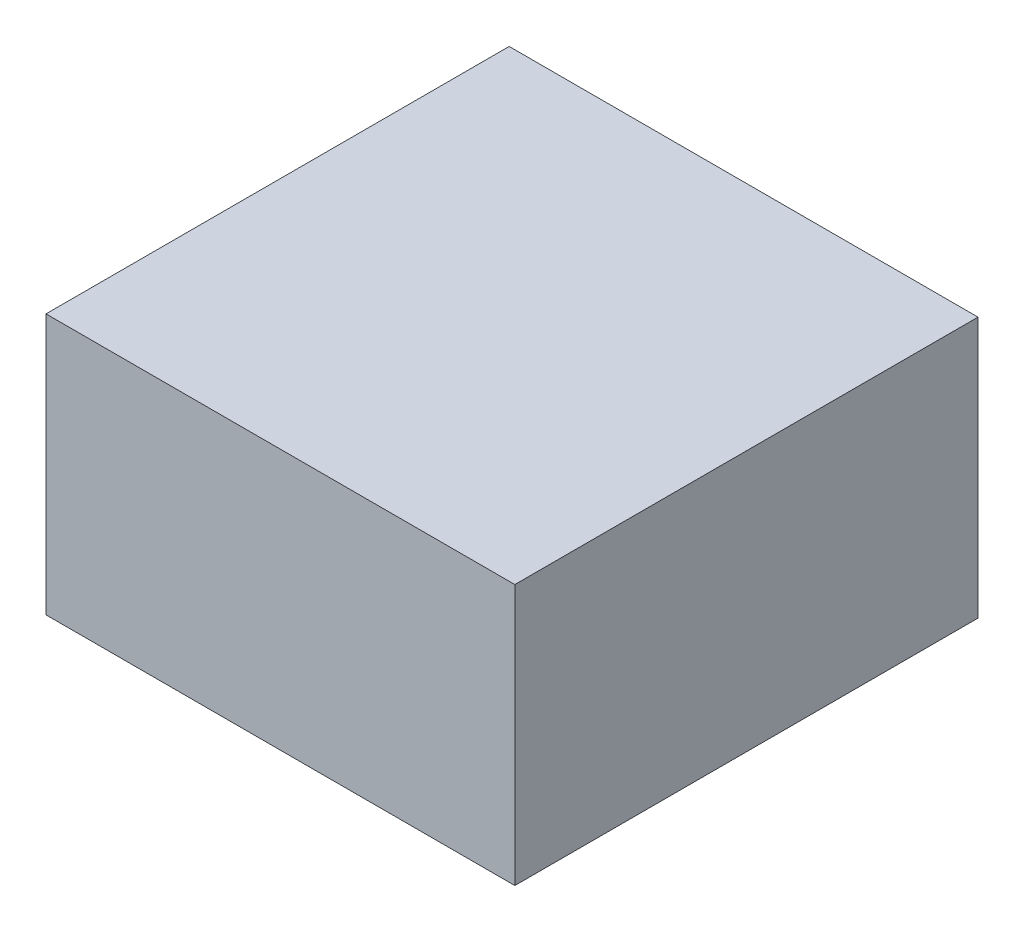
ISO-10303-21;
HEADER;
FILE_DESCRIPTION(('STEP AP214'),'2;1');
FILE_NAME('part.step','',(''),(''),'','','');
FILE_SCHEMA(('AUTOMOTIVE_DESIGN { 1 0 10303 214 1 1 1 1 }'));
ENDSEC;
DATA;
#1=APPLICATION_CONTEXT('core data for automotive mechanical design processes');
#2=APPLICATION_PROTOCOL_DEFINITION('international standard','automotive_design',2000,#1);
#3=PRODUCT_CONTEXT('',#1,'mechanical');
#4=PRODUCT('Part','Part','',(#3));
#5=PRODUCT_RELATED_PRODUCT_CATEGORY('part','',(#4));
#6=PRODUCT_DEFINITION_FORMATION('','',#4);
#7=PRODUCT_DEFINITION_CONTEXT('part definition',#1,'design');
#8=PRODUCT_DEFINITION('design','',#6,#7);
#9=PRODUCT_DEFINITION_SHAPE('','',#8);
#10=(LENGTH_UNIT() NAMED_UNIT(*) SI_UNIT(.MILLI.,.METRE.));
#11=(NAMED_UNIT(*) PLANE_ANGLE_UNIT() SI_UNIT($,.RADIAN.));
#12=(NAMED_UNIT(*) SI_UNIT($,.STERADIAN.) SOLID_ANGLE_UNIT());
#13=UNCERTAINTY_MEASURE_WITH_UNIT(LENGTH_MEASURE(1.E-05),#10,'distance_accuracy_value','');
#14=(GEOMETRIC_REPRESENTATION_CONTEXT(3) GLOBAL_UNCERTAINTY_ASSIGNED_CONTEXT((#13)) GLOBAL_UNIT_ASSIGNED_CONTEXT((#10,
#11,#12)) REPRESENTATION_CONTEXT('',''));
#15=CARTESIAN_POINT('',(0.,0.,0.));
#16=DIRECTION('',(0.,0.,1.));
#17=DIRECTION('',(1.,0.,0.));
#18=AXIS2_PLACEMENT_3D('',#15,#16,#17);
#19=CARTESIAN_POINT('',(0.,202.792786548326,-93.6724));
#20=DIRECTION('',(0.,0.,1.));
#21=DIRECTION('',(1.,0.,0.));
#22=AXIS2_PLACEMENT_3D('',#19,#20,#21);
#23=PLANE('',#22);
#24=DIRECTION('',(0.,-1.,0.));
#25=VECTOR('',#24,1.);
#26=CARTESIAN_POINT('',(0.,202.792786548326,-93.6724));
#27=LINE('',#26,#25);
#28=CARTESIAN_POINT('',(0.,48.1652,-93.6724));
#29=VERTEX_POINT('',#28);
#30=CARTESIAN_POINT('',(0.,-13.,-93.6724));
#31=VERTEX_POINT('',#30);
#32=EDGE_CURVE('E97',#29,#31,#27,.T.);
#33=ORIENTED_EDGE('',*,*,#32,.F.);
#34=DIRECTION('',(1.,0.,0.));
#35=VECTOR('',#34,1.);
#36=CARTESIAN_POINT('',(0.,48.1652,-93.6724));
#37=LINE('',#36,#35);
#38=CARTESIAN_POINT('',(110.,48.1652,-93.6724));
#39=VERTEX_POINT('',#38);
#40=EDGE_CURVE('E36',#29,#39,#37,.T.);
#41=ORIENTED_EDGE('',*,*,#40,.T.);
#42=DIRECTION('',(0.,-1.,0.));
#43=VECTOR('',#42,1.);
#44=CARTESIAN_POINT('',(110.,202.792786548326,-93.6724));
#45=LINE('',#44,#43);
#46=CARTESIAN_POINT('',(110.,-13.,-93.6724));
#47=VERTEX_POINT('',#46);
#48=EDGE_CURVE('E80',#39,#47,#45,.T.);
#49=ORIENTED_EDGE('',*,*,#48,.T.);
#50=DIRECTION('',(-1.,0.,0.));
#51=VECTOR('',#50,1.);
#52=CARTESIAN_POINT('',(0.,-13.,-93.6724));
#53=LINE('',#52,#51);
#54=EDGE_CURVE('E90',#47,#31,#53,.T.);
#55=ORIENTED_EDGE('',*,*,#54,.T.);
#56=EDGE_LOOP('',(#33,#41,#49,#55));
#57=FACE_BOUND('',#56,.T.);
#58=ADVANCED_FACE('F32',(#57),#23,.F.);
#59=CARTESIAN_POINT('',(110.,202.792786548326,-93.6724));
#60=DIRECTION('',(-1.,0.,0.));
#61=DIRECTION('',(0.,0.,1.));
#62=AXIS2_PLACEMENT_3D('',#59,#60,#61);
#63=PLANE('',#62);
#64=ORIENTED_EDGE('',*,*,#48,.F.);
#65=DIRECTION('',(0.,0.,1.));
#66=VECTOR('',#65,1.);
#67=CARTESIAN_POINT('',(110.,48.1652,-93.6724));
#68=LINE('',#67,#66);
#69=CARTESIAN_POINT('',(110.,48.1652,15.));
#70=VERTEX_POINT('',#69);
#71=EDGE_CURVE('E76',#39,#70,#68,.T.);
#72=ORIENTED_EDGE('',*,*,#71,.T.);
#73=DIRECTION('',(0.,-1.,0.));
#74=VECTOR('',#73,1.);
#75=CARTESIAN_POINT('',(110.,202.792786548326,15.));
#76=LINE('',#75,#74);
#77=CARTESIAN_POINT('',(110.,-13.,15.));
#78=VERTEX_POINT('',#77);
#79=EDGE_CURVE('E71',#70,#78,#76,.T.);
#80=ORIENTED_EDGE('',*,*,#79,.T.);
#81=DIRECTION('',(0.,0.,-1.));
#82=VECTOR('',#81,1.);
#83=CARTESIAN_POINT('',(110.,-13.,-93.6724));
#84=LINE('',#83,#82);
#85=EDGE_CURVE('E75',#78,#47,#84,.T.);
#86=ORIENTED_EDGE('',*,*,#85,.T.);
#87=EDGE_LOOP('',(#64,#72,#80,#86));
#88=FACE_BOUND('',#87,.T.);
#89=ADVANCED_FACE('F74',(#88),#63,.F.);
#90=CARTESIAN_POINT('',(0.,202.792786548326,15.));
#91=DIRECTION('',(0.,0.,-1.));
#92=DIRECTION('',(-1.,0.,0.));
#93=AXIS2_PLACEMENT_3D('',#90,#91,#92);
#94=PLANE('',#93);
#95=ORIENTED_EDGE('',*,*,#79,.F.);
#96=DIRECTION('',(-1.,0.,0.));
#97=VECTOR('',#96,1.);
#98=CARTESIAN_POINT('',(0.,48.1652,15.));
#99=LINE('',#98,#97);
#100=CARTESIAN_POINT('',(0.,48.1652,15.));
#101=VERTEX_POINT('',#100);
#102=EDGE_CURVE('E41',#70,#101,#99,.T.);
#103=ORIENTED_EDGE('',*,*,#102,.T.);
#104=DIRECTION('',(0.,-1.,0.));
#105=VECTOR('',#104,1.);
#106=CARTESIAN_POINT('',(0.,202.792786548326,15.));
#107=LINE('',#106,#105);
#108=CARTESIAN_POINT('',(0.,-13.,15.));
#109=VERTEX_POINT('',#108);
#110=EDGE_CURVE('E79',#101,#109,#107,.T.);
#111=ORIENTED_EDGE('',*,*,#110,.T.);
#112=DIRECTION('',(1.,0.,0.));
#113=VECTOR('',#112,1.);
#114=CARTESIAN_POINT('',(0.,-13.,15.));
#115=LINE('',#114,#113);
#116=EDGE_CURVE('E87',#109,#78,#115,.T.);
#117=ORIENTED_EDGE('',*,*,#116,.T.);
#118=EDGE_LOOP('',(#95,#103,#111,#117));
#119=FACE_BOUND('',#118,.T.);
#120=ADVANCED_FACE('F92',(#119),#94,.F.);
#121=CARTESIAN_POINT('',(0.,202.792786548326,-93.6724));
#122=DIRECTION('',(1.,0.,0.));
#123=DIRECTION('',(0.,0.,-1.));
#124=AXIS2_PLACEMENT_3D('',#121,#122,#123);
#125=PLANE('',#124);
#126=ORIENTED_EDGE('',*,*,#110,.F.);
#127=DIRECTION('',(0.,0.,-1.));
#128=VECTOR('',#127,1.);
#129=CARTESIAN_POINT('',(0.,48.1652,-93.6724));
#130=LINE('',#129,#128);
#131=EDGE_CURVE('E11',#101,#29,#130,.T.);
#132=ORIENTED_EDGE('',*,*,#131,.T.);
#133=ORIENTED_EDGE('',*,*,#32,.T.);
#134=DIRECTION('',(0.,0.,1.));
#135=VECTOR('',#134,1.);
#136=CARTESIAN_POINT('',(0.,-13.,-93.6724));
#137=LINE('',#136,#135);
#138=EDGE_CURVE('E95',#31,#109,#137,.T.);
#139=ORIENTED_EDGE('',*,*,#138,.T.);
#140=EDGE_LOOP('',(#126,#132,#133,#139));
#141=FACE_BOUND('',#140,.T.);
#142=ADVANCED_FACE('F34',(#141),#125,.F.);
#143=CARTESIAN_POINT('',(0.,48.1652,0.));
#144=DIRECTION('',(0.,-1.,0.));
#145=DIRECTION('',(0.,0.,-1.));
#146=AXIS2_PLACEMENT_3D('',#143,#144,#145);
#147=PLANE('',#146);
#148=ORIENTED_EDGE('',*,*,#102,.F.);
#149=ORIENTED_EDGE('',*,*,#71,.F.);
#150=ORIENTED_EDGE('',*,*,#40,.F.);
#151=ORIENTED_EDGE('',*,*,#131,.F.);
#152=EDGE_LOOP('',(#148,#149,#150,#151));
#153=FACE_BOUND('',#152,.T.);
#154=ADVANCED_FACE('F105',(#153),#147,.F.);
#155=CARTESIAN_POINT('',(0.,-13.,0.));
#156=DIRECTION('',(0.,-1.,0.));
#157=DIRECTION('',(0.,0.,-1.));
#158=AXIS2_PLACEMENT_3D('',#155,#156,#157);
#159=PLANE('',#158);
#160=ORIENTED_EDGE('',*,*,#138,.F.);
#161=ORIENTED_EDGE('',*,*,#54,.F.);
#162=ORIENTED_EDGE('',*,*,#85,.F.);
#163=ORIENTED_EDGE('',*,*,#116,.F.);
#164=EDGE_LOOP('',(#160,#161,#162,#163));
#165=FACE_BOUND('',#164,.T.);
#166=ADVANCED_FACE('F86',(#165),#159,.T.);
#167=CLOSED_SHELL('',(#58,#89,#120,#142,#154,#166));
#168=MANIFOLD_SOLID_BREP('B2',#167);
#169=ADVANCED_BREP_SHAPE_REPRESENTATION('',(#18,#168),#14);
#170=SHAPE_DEFINITION_REPRESENTATION(#9,#169);
ENDSEC;
END-ISO-10303-21;
